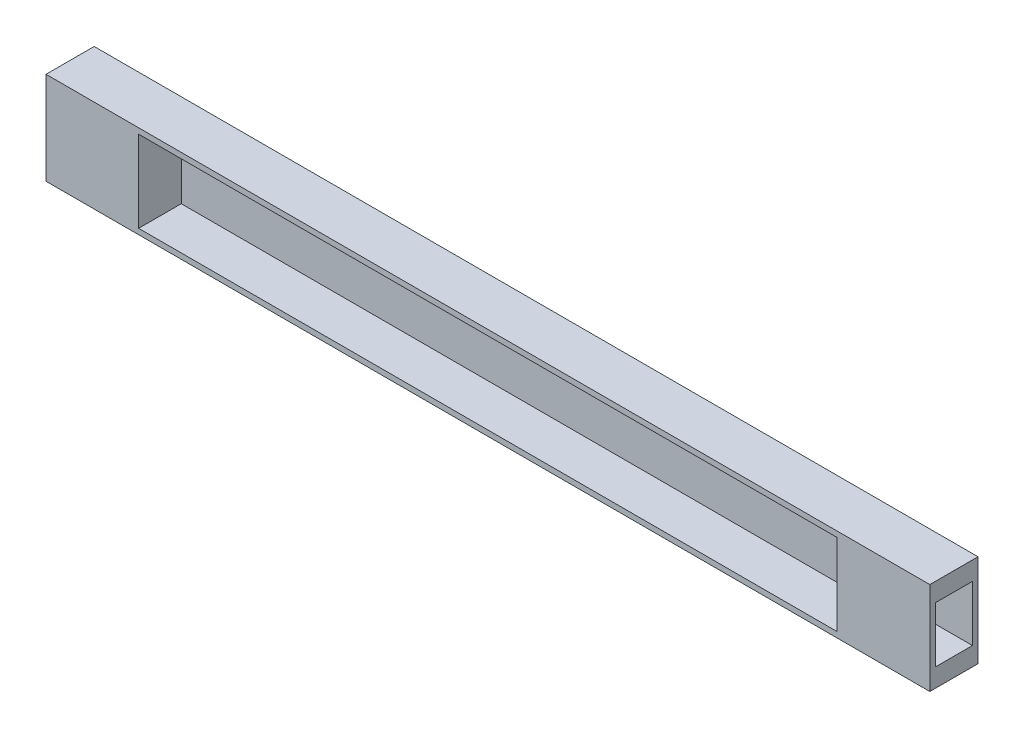
ISO-10303-21;
HEADER;
FILE_DESCRIPTION(('STEP AP214'),'2;1');
FILE_NAME('part.step','',(''),(''),'','','');
FILE_SCHEMA(('AUTOMOTIVE_DESIGN { 1 0 10303 214 1 1 1 1 }'));
ENDSEC;
DATA;
#1=APPLICATION_CONTEXT('core data for automotive mechanical design processes');
#2=APPLICATION_PROTOCOL_DEFINITION('international standard','automotive_design',2000,#1);
#3=PRODUCT_CONTEXT('',#1,'mechanical');
#4=PRODUCT('Part','Part','',(#3));
#5=PRODUCT_RELATED_PRODUCT_CATEGORY('part','',(#4));
#6=PRODUCT_DEFINITION_FORMATION('','',#4);
#7=PRODUCT_DEFINITION_CONTEXT('part definition',#1,'design');
#8=PRODUCT_DEFINITION('design','',#6,#7);
#9=PRODUCT_DEFINITION_SHAPE('','',#8);
#10=(LENGTH_UNIT() NAMED_UNIT(*) SI_UNIT(.MILLI.,.METRE.));
#11=(NAMED_UNIT(*) PLANE_ANGLE_UNIT() SI_UNIT($,.RADIAN.));
#12=(NAMED_UNIT(*) SI_UNIT($,.STERADIAN.) SOLID_ANGLE_UNIT());
#13=UNCERTAINTY_MEASURE_WITH_UNIT(LENGTH_MEASURE(1.E-05),#10,'distance_accuracy_value','');
#14=(GEOMETRIC_REPRESENTATION_CONTEXT(3) GLOBAL_UNCERTAINTY_ASSIGNED_CONTEXT((#13)) GLOBAL_UNIT_ASSIGNED_CONTEXT((#10,
#11,#12)) REPRESENTATION_CONTEXT('',''));
#15=CARTESIAN_POINT('',(0.,0.,0.));
#16=DIRECTION('',(0.,0.,1.));
#17=DIRECTION('',(1.,0.,0.));
#18=AXIS2_PLACEMENT_3D('',#15,#16,#17);
#19=CARTESIAN_POINT('',(416.000008583069,119.999997317791,488.000005483627));
#20=DIRECTION('',(1.,0.,0.));
#21=DIRECTION('',(0.,0.,-1.));
#22=AXIS2_PLACEMENT_3D('',#19,#20,#21);
#23=PLANE('',#22);
#24=DIRECTION('',(0.,1.,0.));
#25=VECTOR('',#24,1.);
#26=CARTESIAN_POINT('',(416.000008583069,119.999997317791,513.999998569489));
#27=LINE('',#26,#25);
#28=CARTESIAN_POINT('',(416.000008583069,119.999997317791,513.999998569489));
#29=VERTEX_POINT('',#28);
#30=CARTESIAN_POINT('',(416.000008583069,170.000001788139,513.999998569489));
#31=VERTEX_POINT('',#30);
#32=EDGE_CURVE('E317',#29,#31,#27,.T.);
#33=ORIENTED_EDGE('',*,*,#32,.F.);
#34=DIRECTION('',(0.,0.,1.));
#35=VECTOR('',#34,1.);
#36=CARTESIAN_POINT('',(416.000008583069,119.999997317791,488.000005483627));
#37=LINE('',#36,#35);
#38=CARTESIAN_POINT('',(416.000008583069,119.999997317791,488.000005483627));
#39=VERTEX_POINT('',#38);
#40=EDGE_CURVE('E41',#39,#29,#37,.T.);
#41=ORIENTED_EDGE('',*,*,#40,.F.);
#42=DIRECTION('',(0.,1.,0.));
#43=VECTOR('',#42,1.);
#44=CARTESIAN_POINT('',(416.000008583069,119.999997317791,488.000005483627));
#45=LINE('',#44,#43);
#46=CARTESIAN_POINT('',(416.000008583069,170.000001788139,488.000005483627));
#47=VERTEX_POINT('',#46);
#48=EDGE_CURVE('E320',#39,#47,#45,.T.);
#49=ORIENTED_EDGE('',*,*,#48,.T.);
#50=DIRECTION('',(0.,0.,1.));
#51=VECTOR('',#50,1.);
#52=CARTESIAN_POINT('',(416.000008583069,170.000001788139,488.000005483627));
#53=LINE('',#52,#51);
#54=EDGE_CURVE('E12',#47,#31,#53,.T.);
#55=ORIENTED_EDGE('',*,*,#54,.T.);
#56=EDGE_LOOP('',(#33,#41,#49,#55));
#57=FACE_BOUND('',#56,.T.);
#58=DIRECTION('',(0.,1.,0.));
#59=VECTOR('',#58,1.);
#60=CARTESIAN_POINT('',(416.000008583069,129.999999552965,511.000002026558));
#61=LINE('',#60,#59);
#62=CARTESIAN_POINT('',(416.000008583069,129.999999552965,511.000002026558));
#63=VERTEX_POINT('',#62);
#64=CARTESIAN_POINT('',(416.000008583069,159.999999552965,511.000002026558));
#65=VERTEX_POINT('',#64);
#66=EDGE_CURVE('E267',#63,#65,#61,.T.);
#67=ORIENTED_EDGE('',*,*,#66,.T.);
#68=DIRECTION('',(0.,0.,-1.));
#69=VECTOR('',#68,1.);
#70=CARTESIAN_POINT('',(416.000008583069,159.999999552965,511.000002026558));
#71=LINE('',#70,#69);
#72=CARTESIAN_POINT('',(416.000008583069,159.999999552965,491.000002026558));
#73=VERTEX_POINT('',#72);
#74=EDGE_CURVE('E261',#65,#73,#71,.T.);
#75=ORIENTED_EDGE('',*,*,#74,.T.);
#76=DIRECTION('',(0.,1.,0.));
#77=VECTOR('',#76,1.);
#78=CARTESIAN_POINT('',(416.000008583069,129.999999552965,491.000002026558));
#79=LINE('',#78,#77);
#80=CARTESIAN_POINT('',(416.000008583069,129.999999552965,491.000002026558));
#81=VERTEX_POINT('',#80);
#82=EDGE_CURVE('E278',#81,#73,#79,.T.);
#83=ORIENTED_EDGE('',*,*,#82,.F.);
#84=DIRECTION('',(0.,0.,-1.));
#85=VECTOR('',#84,1.);
#86=CARTESIAN_POINT('',(416.000008583069,129.999999552965,511.000002026558));
#87=LINE('',#86,#85);
#88=EDGE_CURVE('E281',#63,#81,#87,.T.);
#89=ORIENTED_EDGE('',*,*,#88,.F.);
#90=EDGE_LOOP('',(#67,#75,#83,#89));
#91=FACE_BOUND('',#90,.T.);
#92=ADVANCED_FACE('F37',(#57,#91),#23,.T.);
#93=CARTESIAN_POINT('',(416.000008583069,170.000001788139,488.000005483627));
#94=DIRECTION('',(0.,1.,0.));
#95=DIRECTION('',(0.,0.,1.));
#96=AXIS2_PLACEMENT_3D('',#93,#94,#95);
#97=PLANE('',#96);
#98=DIRECTION('',(-1.,0.,0.));
#99=VECTOR('',#98,1.);
#100=CARTESIAN_POINT('',(416.000008583069,170.000001788139,513.999998569489));
#101=LINE('',#100,#99);
#102=CARTESIAN_POINT('',(-61.0000099539757,170.000001788139,513.999998569489));
#103=VERTEX_POINT('',#102);
#104=EDGE_CURVE('E308',#31,#103,#101,.T.);
#105=ORIENTED_EDGE('',*,*,#104,.F.);
#106=ORIENTED_EDGE('',*,*,#54,.F.);
#107=DIRECTION('',(-1.,0.,0.));
#108=VECTOR('',#107,1.);
#109=CARTESIAN_POINT('',(416.000008583069,170.000001788139,488.000005483627));
#110=LINE('',#109,#108);
#111=CARTESIAN_POINT('',(-61.0000099539757,170.000001788139,488.000005483627));
#112=VERTEX_POINT('',#111);
#113=EDGE_CURVE('E314',#47,#112,#110,.T.);
#114=ORIENTED_EDGE('',*,*,#113,.T.);
#115=DIRECTION('',(0.,0.,1.));
#116=VECTOR('',#115,1.);
#117=CARTESIAN_POINT('',(-61.0000099539757,170.000001788139,488.000005483627));
#118=LINE('',#117,#116);
#119=EDGE_CURVE('E258',#112,#103,#118,.T.);
#120=ORIENTED_EDGE('',*,*,#119,.T.);
#121=EDGE_LOOP('',(#105,#106,#114,#120));
#122=FACE_BOUND('',#121,.T.);
#123=ADVANCED_FACE('F39',(#122),#97,.T.);
#124=CARTESIAN_POINT('',(-61.0000006854534,119.999997317791,488.000005483627));
#125=DIRECTION('',(0.,-1.,0.));
#126=DIRECTION('',(0.,0.,-1.));
#127=AXIS2_PLACEMENT_3D('',#124,#125,#126);
#128=PLANE('',#127);
#129=DIRECTION('',(1.,0.,0.));
#130=VECTOR('',#129,1.);
#131=CARTESIAN_POINT('',(-61.0000006854534,119.999997317791,513.999998569489));
#132=LINE('',#131,#130);
#133=CARTESIAN_POINT('',(-61.0000099539757,119.999997317791,513.999998569489));
#134=VERTEX_POINT('',#133);
#135=EDGE_CURVE('E324',#134,#29,#132,.T.);
#136=ORIENTED_EDGE('',*,*,#135,.F.);
#137=DIRECTION('',(0.,0.,1.));
#138=VECTOR('',#137,1.);
#139=CARTESIAN_POINT('',(-61.0000099539757,119.999997317791,488.000005483627));
#140=LINE('',#139,#138);
#141=CARTESIAN_POINT('',(-61.0000099539757,119.999997317791,488.000005483627));
#142=VERTEX_POINT('',#141);
#143=EDGE_CURVE('E255',#142,#134,#140,.T.);
#144=ORIENTED_EDGE('',*,*,#143,.F.);
#145=DIRECTION('',(1.,0.,0.));
#146=VECTOR('',#145,1.);
#147=CARTESIAN_POINT('',(-61.0000006854534,119.999997317791,488.000005483627));
#148=LINE('',#147,#146);
#149=EDGE_CURVE('E316',#142,#39,#148,.T.);
#150=ORIENTED_EDGE('',*,*,#149,.T.);
#151=ORIENTED_EDGE('',*,*,#40,.T.);
#152=EDGE_LOOP('',(#136,#144,#150,#151));
#153=FACE_BOUND('',#152,.T.);
#154=ADVANCED_FACE('F345',(#153),#128,.T.);
#155=CARTESIAN_POINT('',(0.,0.,488.000005483627));
#156=DIRECTION('',(0.,0.,1.));
#157=DIRECTION('',(1.,0.,0.));
#158=AXIS2_PLACEMENT_3D('',#155,#156,#157);
#159=PLANE('',#158);
#160=DIRECTION('',(0.,1.,0.));
#161=VECTOR('',#160,1.);
#162=CARTESIAN_POINT('',(187.499999314547,134.999999552965,488.000005483627));
#163=LINE('',#162,#161);
#164=CARTESIAN_POINT('',(187.499999314547,134.999999552965,488.000005483627));
#165=VERTEX_POINT('',#164);
#166=CARTESIAN_POINT('',(187.499999314547,154.999999552965,488.000005483627));
#167=VERTEX_POINT('',#166);
#168=EDGE_CURVE('E52',#165,#167,#163,.T.);
#169=ORIENTED_EDGE('',*,*,#168,.T.);
#170=DIRECTION('',(-1.,0.,0.));
#171=VECTOR('',#170,1.);
#172=CARTESIAN_POINT('',(187.499999314547,154.999999552965,488.000005483627));
#173=LINE('',#172,#171);
#174=CARTESIAN_POINT('',(167.499999314547,154.999999552965,488.000005483627));
#175=VERTEX_POINT('',#174);
#176=EDGE_CURVE('E202',#167,#175,#173,.T.);
#177=ORIENTED_EDGE('',*,*,#176,.T.);
#178=DIRECTION('',(0.,1.,0.));
#179=VECTOR('',#178,1.);
#180=CARTESIAN_POINT('',(167.499999314547,134.999999552965,488.000005483627));
#181=LINE('',#180,#179);
#182=CARTESIAN_POINT('',(167.499999314547,134.999999552965,488.000005483627));
#183=VERTEX_POINT('',#182);
#184=EDGE_CURVE('E189',#183,#175,#181,.T.);
#185=ORIENTED_EDGE('',*,*,#184,.F.);
#186=DIRECTION('',(-1.,0.,0.));
#187=VECTOR('',#186,1.);
#188=CARTESIAN_POINT('',(187.499999314547,134.999999552965,488.000005483627));
#189=LINE('',#188,#187);
#190=EDGE_CURVE('E57',#165,#183,#189,.T.);
#191=ORIENTED_EDGE('',*,*,#190,.F.);
#192=EDGE_LOOP('',(#169,#177,#185,#191));
#193=FACE_BOUND('',#192,.T.);
#194=ORIENTED_EDGE('',*,*,#113,.F.);
#195=ORIENTED_EDGE('',*,*,#48,.F.);
#196=ORIENTED_EDGE('',*,*,#149,.F.);
#197=DIRECTION('',(0.,1.,0.));
#198=VECTOR('',#197,1.);
#199=CARTESIAN_POINT('',(-61.0000099539757,119.999997317791,488.000005483627));
#200=LINE('',#199,#198);
#201=EDGE_CURVE('E252',#142,#112,#200,.T.);
#202=ORIENTED_EDGE('',*,*,#201,.T.);
#203=EDGE_LOOP('',(#194,#195,#196,#202));
#204=FACE_BOUND('',#203,.T.);
#205=ADVANCED_FACE('F347',(#193,#204),#159,.F.);
#206=CARTESIAN_POINT('',(0.,0.,513.999998569489));
#207=DIRECTION('',(0.,0.,1.));
#208=DIRECTION('',(1.,0.,0.));
#209=AXIS2_PLACEMENT_3D('',#206,#207,#208);
#210=PLANE('',#209);
#211=DIRECTION('',(0.,1.,0.));
#212=VECTOR('',#211,1.);
#213=CARTESIAN_POINT('',(-10.9999980330467,123.000003397465,513.999998569489));
#214=LINE('',#213,#212);
#215=CARTESIAN_POINT('',(-10.9999980330467,123.000003397465,513.999998569489));
#216=VERTEX_POINT('',#215);
#217=CARTESIAN_POINT('',(-10.9999980330467,166.999995708466,513.999998569489));
#218=VERTEX_POINT('',#217);
#219=EDGE_CURVE('E239',#216,#218,#214,.T.);
#220=ORIENTED_EDGE('',*,*,#219,.T.);
#221=DIRECTION('',(-1.,0.,0.));
#222=VECTOR('',#221,1.);
#223=CARTESIAN_POINT('',(365.99999666214,166.999995708466,513.999998569489));
#224=LINE('',#223,#222);
#225=CARTESIAN_POINT('',(365.99999666214,166.999995708466,513.999998569489));
#226=VERTEX_POINT('',#225);
#227=EDGE_CURVE('E305',#226,#218,#224,.T.);
#228=ORIENTED_EDGE('',*,*,#227,.F.);
#229=DIRECTION('',(0.,1.,0.));
#230=VECTOR('',#229,1.);
#231=CARTESIAN_POINT('',(365.99999666214,123.000003397465,513.999998569489));
#232=LINE('',#231,#230);
#233=CARTESIAN_POINT('',(365.99999666214,123.000003397465,513.999998569489));
#234=VERTEX_POINT('',#233);
#235=EDGE_CURVE('E294',#234,#226,#232,.T.);
#236=ORIENTED_EDGE('',*,*,#235,.F.);
#237=DIRECTION('',(-1.,0.,0.));
#238=VECTOR('',#237,1.);
#239=CARTESIAN_POINT('',(365.99999666214,123.000003397465,513.999998569489));
#240=LINE('',#239,#238);
#241=EDGE_CURVE('E306',#234,#216,#240,.T.);
#242=ORIENTED_EDGE('',*,*,#241,.T.);
#243=EDGE_LOOP('',(#220,#228,#236,#242));
#244=FACE_BOUND('',#243,.T.);
#245=ORIENTED_EDGE('',*,*,#104,.T.);
#246=DIRECTION('',(0.,1.,0.));
#247=VECTOR('',#246,1.);
#248=CARTESIAN_POINT('',(-61.0000099539757,119.999997317791,513.999998569489));
#249=LINE('',#248,#247);
#250=EDGE_CURVE('E251',#134,#103,#249,.T.);
#251=ORIENTED_EDGE('',*,*,#250,.F.);
#252=ORIENTED_EDGE('',*,*,#135,.T.);
#253=ORIENTED_EDGE('',*,*,#32,.T.);
#254=EDGE_LOOP('',(#245,#251,#252,#253));
#255=FACE_BOUND('',#254,.T.);
#256=ADVANCED_FACE('F330',(#244,#255),#210,.T.);
#257=CARTESIAN_POINT('',(365.99999666214,123.000003397465,490.99999666214));
#258=DIRECTION('',(0.,-1.,0.));
#259=DIRECTION('',(0.,0.,-1.));
#260=AXIS2_PLACEMENT_3D('',#257,#258,#259);
#261=PLANE('',#260);
#262=DIRECTION('',(-1.,0.,0.));
#263=VECTOR('',#262,1.);
#264=CARTESIAN_POINT('',(365.99999666214,123.000003397465,490.99999666214));
#265=LINE('',#264,#263);
#266=CARTESIAN_POINT('',(365.99999666214,123.000003397465,490.99999666214));
#267=VERTEX_POINT('',#266);
#268=CARTESIAN_POINT('',(-10.9999980330467,123.000003397465,490.99999666214));
#269=VERTEX_POINT('',#268);
#270=EDGE_CURVE('E309',#267,#269,#265,.T.);
#271=ORIENTED_EDGE('',*,*,#270,.T.);
#272=DIRECTION('',(0.,0.,1.));
#273=VECTOR('',#272,1.);
#274=CARTESIAN_POINT('',(-10.9999980330467,123.000003397465,490.99999666214));
#275=LINE('',#274,#273);
#276=EDGE_CURVE('E248',#269,#216,#275,.T.);
#277=ORIENTED_EDGE('',*,*,#276,.T.);
#278=ORIENTED_EDGE('',*,*,#241,.F.);
#279=DIRECTION('',(0.,0.,1.));
#280=VECTOR('',#279,1.);
#281=CARTESIAN_POINT('',(365.99999666214,123.000003397465,490.99999666214));
#282=LINE('',#281,#280);
#283=EDGE_CURVE('E303',#267,#234,#282,.T.);
#284=ORIENTED_EDGE('',*,*,#283,.F.);
#285=EDGE_LOOP('',(#271,#277,#278,#284));
#286=FACE_BOUND('',#285,.T.);
#287=ADVANCED_FACE('F354',(#286),#261,.F.);
#288=CARTESIAN_POINT('',(365.99999666214,166.999995708466,490.99999666214));
#289=DIRECTION('',(0.,0.,-1.));
#290=DIRECTION('',(-1.,0.,0.));
#291=AXIS2_PLACEMENT_3D('',#288,#289,#290);
#292=PLANE('',#291);
#293=DIRECTION('',(-1.,0.,0.));
#294=VECTOR('',#293,1.);
#295=CARTESIAN_POINT('',(365.99999666214,166.999995708466,490.99999666214));
#296=LINE('',#295,#294);
#297=CARTESIAN_POINT('',(365.99999666214,166.999995708466,490.99999666214));
#298=VERTEX_POINT('',#297);
#299=CARTESIAN_POINT('',(-10.9999980330467,166.999995708466,490.99999666214));
#300=VERTEX_POINT('',#299);
#301=EDGE_CURVE('E311',#298,#300,#296,.T.);
#302=ORIENTED_EDGE('',*,*,#301,.T.);
#303=DIRECTION('',(0.,-1.,0.));
#304=VECTOR('',#303,1.);
#305=CARTESIAN_POINT('',(-10.9999980330467,166.999995708466,490.99999666214));
#306=LINE('',#305,#304);
#307=EDGE_CURVE('E245',#300,#269,#306,.T.);
#308=ORIENTED_EDGE('',*,*,#307,.T.);
#309=ORIENTED_EDGE('',*,*,#270,.F.);
#310=DIRECTION('',(0.,-1.,0.));
#311=VECTOR('',#310,1.);
#312=CARTESIAN_POINT('',(365.99999666214,166.999995708466,490.99999666214));
#313=LINE('',#312,#311);
#314=EDGE_CURVE('E300',#298,#267,#313,.T.);
#315=ORIENTED_EDGE('',*,*,#314,.F.);
#316=EDGE_LOOP('',(#302,#308,#309,#315));
#317=FACE_BOUND('',#316,.T.);
#318=ADVANCED_FACE('F388',(#317),#292,.F.);
#319=CARTESIAN_POINT('',(365.99999666214,166.999995708466,513.999998569489));
#320=DIRECTION('',(0.,1.,0.));
#321=DIRECTION('',(0.,0.,1.));
#322=AXIS2_PLACEMENT_3D('',#319,#320,#321);
#323=PLANE('',#322);
#324=ORIENTED_EDGE('',*,*,#227,.T.);
#325=DIRECTION('',(0.,0.,-1.));
#326=VECTOR('',#325,1.);
#327=CARTESIAN_POINT('',(-10.9999980330467,166.999995708466,513.999998569489));
#328=LINE('',#327,#326);
#329=EDGE_CURVE('E242',#218,#300,#328,.T.);
#330=ORIENTED_EDGE('',*,*,#329,.T.);
#331=ORIENTED_EDGE('',*,*,#301,.F.);
#332=DIRECTION('',(0.,0.,-1.));
#333=VECTOR('',#332,1.);
#334=CARTESIAN_POINT('',(365.99999666214,166.999995708466,513.999998569489));
#335=LINE('',#334,#333);
#336=EDGE_CURVE('E297',#226,#298,#335,.T.);
#337=ORIENTED_EDGE('',*,*,#336,.F.);
#338=EDGE_LOOP('',(#324,#330,#331,#337));
#339=FACE_BOUND('',#338,.T.);
#340=ADVANCED_FACE('F399',(#339),#323,.F.);
#341=CARTESIAN_POINT('',(365.99999666214,0.,0.));
#342=DIRECTION('',(-1.,0.,0.));
#343=DIRECTION('',(0.,0.,1.));
#344=AXIS2_PLACEMENT_3D('',#341,#342,#343);
#345=PLANE('',#344);
#346=ORIENTED_EDGE('',*,*,#235,.T.);
#347=ORIENTED_EDGE('',*,*,#336,.T.);
#348=ORIENTED_EDGE('',*,*,#314,.T.);
#349=ORIENTED_EDGE('',*,*,#283,.T.);
#350=EDGE_LOOP('',(#346,#347,#348,#349));
#351=FACE_BOUND('',#350,.T.);
#352=ADVANCED_FACE('F410',(#351),#345,.T.);
#353=CARTESIAN_POINT('',(386.000008583069,159.999999552965,511.000002026558));
#354=DIRECTION('',(0.,-1.,0.));
#355=DIRECTION('',(0.,0.,-1.));
#356=AXIS2_PLACEMENT_3D('',#353,#354,#355);
#357=PLANE('',#356);
#358=ORIENTED_EDGE('',*,*,#74,.F.);
#359=DIRECTION('',(1.,0.,0.));
#360=VECTOR('',#359,1.);
#361=CARTESIAN_POINT('',(386.000008583069,159.999999552965,511.000002026558));
#362=LINE('',#361,#360);
#363=CARTESIAN_POINT('',(386.000008583069,159.999999552965,511.000002026558));
#364=VERTEX_POINT('',#363);
#365=EDGE_CURVE('E275',#364,#65,#362,.T.);
#366=ORIENTED_EDGE('',*,*,#365,.F.);
#367=DIRECTION('',(0.,0.,-1.));
#368=VECTOR('',#367,1.);
#369=CARTESIAN_POINT('',(386.000008583069,159.999999552965,511.000002026558));
#370=LINE('',#369,#368);
#371=CARTESIAN_POINT('',(386.000008583069,159.999999552965,491.000002026558));
#372=VERTEX_POINT('',#371);
#373=EDGE_CURVE('E264',#364,#372,#370,.T.);
#374=ORIENTED_EDGE('',*,*,#373,.T.);
#375=DIRECTION('',(1.,0.,0.));
#376=VECTOR('',#375,1.);
#377=CARTESIAN_POINT('',(386.000008583069,159.999999552965,491.000002026558));
#378=LINE('',#377,#376);
#379=EDGE_CURVE('E292',#372,#73,#378,.T.);
#380=ORIENTED_EDGE('',*,*,#379,.T.);
#381=EDGE_LOOP('',(#358,#366,#374,#380));
#382=FACE_BOUND('',#381,.T.);
#383=ADVANCED_FACE('F549',(#382),#357,.T.);
#384=CARTESIAN_POINT('',(386.000008583069,129.999999552965,491.000002026558));
#385=DIRECTION('',(0.,0.,-1.));
#386=DIRECTION('',(-1.,0.,0.));
#387=AXIS2_PLACEMENT_3D('',#384,#385,#386);
#388=PLANE('',#387);
#389=ORIENTED_EDGE('',*,*,#82,.T.);
#390=ORIENTED_EDGE('',*,*,#379,.F.);
#391=DIRECTION('',(0.,1.,0.));
#392=VECTOR('',#391,1.);
#393=CARTESIAN_POINT('',(386.000008583069,129.999999552965,491.000002026558));
#394=LINE('',#393,#392);
#395=CARTESIAN_POINT('',(386.000008583069,129.999999552965,491.000002026558));
#396=VERTEX_POINT('',#395);
#397=EDGE_CURVE('E266',#396,#372,#394,.T.);
#398=ORIENTED_EDGE('',*,*,#397,.F.);
#399=DIRECTION('',(1.,0.,0.));
#400=VECTOR('',#399,1.);
#401=CARTESIAN_POINT('',(386.000008583069,129.999999552965,491.000002026558));
#402=LINE('',#401,#400);
#403=EDGE_CURVE('E290',#396,#81,#402,.T.);
#404=ORIENTED_EDGE('',*,*,#403,.T.);
#405=EDGE_LOOP('',(#389,#390,#398,#404));
#406=FACE_BOUND('',#405,.T.);
#407=ADVANCED_FACE('F545',(#406),#388,.F.);
#408=CARTESIAN_POINT('',(386.000008583069,129.999999552965,511.000002026558));
#409=DIRECTION('',(0.,-1.,0.));
#410=DIRECTION('',(0.,0.,-1.));
#411=AXIS2_PLACEMENT_3D('',#408,#409,#410);
#412=PLANE('',#411);
#413=ORIENTED_EDGE('',*,*,#88,.T.);
#414=ORIENTED_EDGE('',*,*,#403,.F.);
#415=DIRECTION('',(0.,0.,-1.));
#416=VECTOR('',#415,1.);
#417=CARTESIAN_POINT('',(386.000008583069,129.999999552965,511.000002026558));
#418=LINE('',#417,#416);
#419=CARTESIAN_POINT('',(386.000008583069,129.999999552965,511.000002026558));
#420=VERTEX_POINT('',#419);
#421=EDGE_CURVE('E270',#420,#396,#418,.T.);
#422=ORIENTED_EDGE('',*,*,#421,.F.);
#423=DIRECTION('',(1.,0.,0.));
#424=VECTOR('',#423,1.);
#425=CARTESIAN_POINT('',(386.000008583069,129.999999552965,511.000002026558));
#426=LINE('',#425,#424);
#427=EDGE_CURVE('E288',#420,#63,#426,.T.);
#428=ORIENTED_EDGE('',*,*,#427,.T.);
#429=EDGE_LOOP('',(#413,#414,#422,#428));
#430=FACE_BOUND('',#429,.T.);
#431=ADVANCED_FACE('F541',(#430),#412,.F.);
#432=CARTESIAN_POINT('',(386.000008583069,129.999999552965,511.000002026558));
#433=DIRECTION('',(0.,0.,-1.));
#434=DIRECTION('',(-1.,0.,0.));
#435=AXIS2_PLACEMENT_3D('',#432,#433,#434);
#436=PLANE('',#435);
#437=ORIENTED_EDGE('',*,*,#66,.F.);
#438=ORIENTED_EDGE('',*,*,#427,.F.);
#439=DIRECTION('',(0.,1.,0.));
#440=VECTOR('',#439,1.);
#441=CARTESIAN_POINT('',(386.000008583069,129.999999552965,511.000002026558));
#442=LINE('',#441,#440);
#443=EDGE_CURVE('E273',#420,#364,#442,.T.);
#444=ORIENTED_EDGE('',*,*,#443,.T.);
#445=ORIENTED_EDGE('',*,*,#365,.T.);
#446=EDGE_LOOP('',(#437,#438,#444,#445));
#447=FACE_BOUND('',#446,.T.);
#448=ADVANCED_FACE('F537',(#447),#436,.T.);
#449=CARTESIAN_POINT('',(386.000008583069,0.,0.));
#450=DIRECTION('',(1.,0.,0.));
#451=DIRECTION('',(0.,0.,-1.));
#452=AXIS2_PLACEMENT_3D('',#449,#450,#451);
#453=PLANE('',#452);
#454=ORIENTED_EDGE('',*,*,#373,.F.);
#455=ORIENTED_EDGE('',*,*,#443,.F.);
#456=ORIENTED_EDGE('',*,*,#421,.T.);
#457=ORIENTED_EDGE('',*,*,#397,.T.);
#458=EDGE_LOOP('',(#454,#455,#456,#457));
#459=FACE_BOUND('',#458,.T.);
#460=ADVANCED_FACE('F423',(#459),#453,.T.);
#461=CARTESIAN_POINT('',(-61.0000099539757,119.999997317791,488.000005483627));
#462=DIRECTION('',(-1.,0.,0.));
#463=DIRECTION('',(0.,0.,-1.));
#464=AXIS2_PLACEMENT_3D('',#461,#462,#463);
#465=PLANE('',#464);
#466=ORIENTED_EDGE('',*,*,#250,.T.);
#467=ORIENTED_EDGE('',*,*,#119,.F.);
#468=ORIENTED_EDGE('',*,*,#201,.F.);
#469=ORIENTED_EDGE('',*,*,#143,.T.);
#470=EDGE_LOOP('',(#466,#467,#468,#469));
#471=FACE_BOUND('',#470,.T.);
#472=DIRECTION('',(0.,1.,0.));
#473=VECTOR('',#472,1.);
#474=CARTESIAN_POINT('',(-61.0000099539757,129.999999552965,511.000002026558));
#475=LINE('',#474,#473);
#476=CARTESIAN_POINT('',(-61.0000099539757,129.999999552965,511.000002026558));
#477=VERTEX_POINT('',#476);
#478=CARTESIAN_POINT('',(-61.0000099539757,159.999999552965,511.000002026558));
#479=VERTEX_POINT('',#478);
#480=EDGE_CURVE('E215',#477,#479,#475,.T.);
#481=ORIENTED_EDGE('',*,*,#480,.F.);
#482=DIRECTION('',(0.,0.,-1.));
#483=VECTOR('',#482,1.);
#484=CARTESIAN_POINT('',(-61.0000099539757,129.999999552965,511.000002026558));
#485=LINE('',#484,#483);
#486=CARTESIAN_POINT('',(-61.0000099539757,129.999999552965,491.000002026558));
#487=VERTEX_POINT('',#486);
#488=EDGE_CURVE('E227',#477,#487,#485,.T.);
#489=ORIENTED_EDGE('',*,*,#488,.T.);
#490=DIRECTION('',(0.,1.,0.));
#491=VECTOR('',#490,1.);
#492=CARTESIAN_POINT('',(-61.0000099539757,129.999999552965,491.000002026558));
#493=LINE('',#492,#491);
#494=CARTESIAN_POINT('',(-61.0000099539757,159.999999552965,491.000002026558));
#495=VERTEX_POINT('',#494);
#496=EDGE_CURVE('E224',#487,#495,#493,.T.);
#497=ORIENTED_EDGE('',*,*,#496,.T.);
#498=DIRECTION('',(0.,0.,-1.));
#499=VECTOR('',#498,1.);
#500=CARTESIAN_POINT('',(-61.0000099539757,159.999999552965,511.000002026558));
#501=LINE('',#500,#499);
#502=EDGE_CURVE('E207',#479,#495,#501,.T.);
#503=ORIENTED_EDGE('',*,*,#502,.F.);
#504=EDGE_LOOP('',(#481,#489,#497,#503));
#505=FACE_BOUND('',#504,.T.);
#506=ADVANCED_FACE('F341',(#471,#505),#465,.T.);
#507=CARTESIAN_POINT('',(-10.9999980330467,0.,0.));
#508=DIRECTION('',(1.,0.,0.));
#509=DIRECTION('',(0.,0.,1.));
#510=AXIS2_PLACEMENT_3D('',#507,#508,#509);
#511=PLANE('',#510);
#512=ORIENTED_EDGE('',*,*,#219,.F.);
#513=ORIENTED_EDGE('',*,*,#276,.F.);
#514=ORIENTED_EDGE('',*,*,#307,.F.);
#515=ORIENTED_EDGE('',*,*,#329,.F.);
#516=EDGE_LOOP('',(#512,#513,#514,#515));
#517=FACE_BOUND('',#516,.T.);
#518=ADVANCED_FACE('F422',(#517),#511,.T.);
#519=CARTESIAN_POINT('',(-31.0000099539757,159.999999552965,511.000002026558));
#520=DIRECTION('',(0.,-1.,0.));
#521=DIRECTION('',(0.,0.,-1.));
#522=AXIS2_PLACEMENT_3D('',#519,#520,#521);
#523=PLANE('',#522);
#524=ORIENTED_EDGE('',*,*,#502,.T.);
#525=DIRECTION('',(-1.,0.,0.));
#526=VECTOR('',#525,1.);
#527=CARTESIAN_POINT('',(-31.0000099539757,159.999999552965,491.000002026558));
#528=LINE('',#527,#526);
#529=CARTESIAN_POINT('',(-31.0000099539757,159.999999552965,491.000002026558));
#530=VERTEX_POINT('',#529);
#531=EDGE_CURVE('E237',#530,#495,#528,.T.);
#532=ORIENTED_EDGE('',*,*,#531,.F.);
#533=DIRECTION('',(0.,0.,-1.));
#534=VECTOR('',#533,1.);
#535=CARTESIAN_POINT('',(-31.0000099539757,159.999999552965,511.000002026558));
#536=LINE('',#535,#534);
#537=CARTESIAN_POINT('',(-31.0000099539757,159.999999552965,511.000002026558));
#538=VERTEX_POINT('',#537);
#539=EDGE_CURVE('E211',#538,#530,#536,.T.);
#540=ORIENTED_EDGE('',*,*,#539,.F.);
#541=DIRECTION('',(-1.,0.,0.));
#542=VECTOR('',#541,1.);
#543=CARTESIAN_POINT('',(-31.0000099539757,159.999999552965,511.000002026558));
#544=LINE('',#543,#542);
#545=EDGE_CURVE('E221',#538,#479,#544,.T.);
#546=ORIENTED_EDGE('',*,*,#545,.T.);
#547=EDGE_LOOP('',(#524,#532,#540,#546));
#548=FACE_BOUND('',#547,.T.);
#549=ADVANCED_FACE('F433',(#548),#523,.T.);
#550=CARTESIAN_POINT('',(-31.0000099539757,129.999999552965,491.000002026558));
#551=DIRECTION('',(0.,0.,-1.));
#552=DIRECTION('',(1.,0.,0.));
#553=AXIS2_PLACEMENT_3D('',#550,#551,#552);
#554=PLANE('',#553);
#555=ORIENTED_EDGE('',*,*,#496,.F.);
#556=DIRECTION('',(-1.,0.,0.));
#557=VECTOR('',#556,1.);
#558=CARTESIAN_POINT('',(-31.0000099539757,129.999999552965,491.000002026558));
#559=LINE('',#558,#557);
#560=CARTESIAN_POINT('',(-31.0000099539757,129.999999552965,491.000002026558));
#561=VERTEX_POINT('',#560);
#562=EDGE_CURVE('E235',#561,#487,#559,.T.);
#563=ORIENTED_EDGE('',*,*,#562,.F.);
#564=DIRECTION('',(0.,1.,0.));
#565=VECTOR('',#564,1.);
#566=CARTESIAN_POINT('',(-31.0000099539757,129.999999552965,491.000002026558));
#567=LINE('',#566,#565);
#568=EDGE_CURVE('E214',#561,#530,#567,.T.);
#569=ORIENTED_EDGE('',*,*,#568,.T.);
#570=ORIENTED_EDGE('',*,*,#531,.T.);
#571=EDGE_LOOP('',(#555,#563,#569,#570));
#572=FACE_BOUND('',#571,.T.);
#573=ADVANCED_FACE('F443',(#572),#554,.F.);
#574=CARTESIAN_POINT('',(-31.0000099539757,129.999999552965,511.000002026558));
#575=DIRECTION('',(0.,-1.,0.));
#576=DIRECTION('',(0.,0.,-1.));
#577=AXIS2_PLACEMENT_3D('',#574,#575,#576);
#578=PLANE('',#577);
#579=ORIENTED_EDGE('',*,*,#488,.F.);
#580=DIRECTION('',(-1.,0.,0.));
#581=VECTOR('',#580,1.);
#582=CARTESIAN_POINT('',(-31.0000099539757,129.999999552965,511.000002026558));
#583=LINE('',#582,#581);
#584=CARTESIAN_POINT('',(-31.0000099539757,129.999999552965,511.000002026558));
#585=VERTEX_POINT('',#584);
#586=EDGE_CURVE('E233',#585,#477,#583,.T.);
#587=ORIENTED_EDGE('',*,*,#586,.F.);
#588=DIRECTION('',(0.,0.,-1.));
#589=VECTOR('',#588,1.);
#590=CARTESIAN_POINT('',(-31.0000099539757,129.999999552965,511.000002026558));
#591=LINE('',#590,#589);
#592=EDGE_CURVE('E217',#585,#561,#591,.T.);
#593=ORIENTED_EDGE('',*,*,#592,.T.);
#594=ORIENTED_EDGE('',*,*,#562,.T.);
#595=EDGE_LOOP('',(#579,#587,#593,#594));
#596=FACE_BOUND('',#595,.T.);
#597=ADVANCED_FACE('F453',(#596),#578,.F.);
#598=CARTESIAN_POINT('',(-31.0000099539757,129.999999552965,511.000002026558));
#599=DIRECTION('',(0.,0.,-1.));
#600=DIRECTION('',(1.,0.,0.));
#601=AXIS2_PLACEMENT_3D('',#598,#599,#600);
#602=PLANE('',#601);
#603=ORIENTED_EDGE('',*,*,#480,.T.);
#604=ORIENTED_EDGE('',*,*,#545,.F.);
#605=DIRECTION('',(0.,1.,0.));
#606=VECTOR('',#605,1.);
#607=CARTESIAN_POINT('',(-31.0000099539757,129.999999552965,511.000002026558));
#608=LINE('',#607,#606);
#609=EDGE_CURVE('E219',#585,#538,#608,.T.);
#610=ORIENTED_EDGE('',*,*,#609,.F.);
#611=ORIENTED_EDGE('',*,*,#586,.T.);
#612=EDGE_LOOP('',(#603,#604,#610,#611));
#613=FACE_BOUND('',#612,.T.);
#614=ADVANCED_FACE('F463',(#613),#602,.T.);
#615=CARTESIAN_POINT('',(-31.0000099539757,0.,0.));
#616=DIRECTION('',(-1.,0.,0.));
#617=DIRECTION('',(0.,0.,-1.));
#618=AXIS2_PLACEMENT_3D('',#615,#616,#617);
#619=PLANE('',#618);
#620=ORIENTED_EDGE('',*,*,#539,.T.);
#621=ORIENTED_EDGE('',*,*,#568,.F.);
#622=ORIENTED_EDGE('',*,*,#592,.F.);
#623=ORIENTED_EDGE('',*,*,#609,.T.);
#624=EDGE_LOOP('',(#620,#621,#622,#623));
#625=FACE_BOUND('',#624,.T.);
#626=ADVANCED_FACE('F473',(#625),#619,.T.);
#627=CARTESIAN_POINT('',(187.499999314547,154.999999552965,478.000005483627));
#628=DIRECTION('',(0.,1.,0.));
#629=DIRECTION('',(0.,0.,1.));
#630=AXIS2_PLACEMENT_3D('',#627,#628,#629);
#631=PLANE('',#630);
#632=ORIENTED_EDGE('',*,*,#176,.F.);
#633=DIRECTION('',(0.,0.,1.));
#634=VECTOR('',#633,1.);
#635=CARTESIAN_POINT('',(187.499999314547,154.999999552965,478.000005483627));
#636=LINE('',#635,#634);
#637=CARTESIAN_POINT('',(187.499999314547,154.999999552965,478.000005483627));
#638=VERTEX_POINT('',#637);
#639=EDGE_CURVE('E196',#638,#167,#636,.T.);
#640=ORIENTED_EDGE('',*,*,#639,.F.);
#641=DIRECTION('',(-1.,0.,0.));
#642=VECTOR('',#641,1.);
#643=CARTESIAN_POINT('',(187.499999314547,154.999999552965,478.000005483627));
#644=LINE('',#643,#642);
#645=CARTESIAN_POINT('',(167.499999314547,154.999999552965,478.000005483627));
#646=VERTEX_POINT('',#645);
#647=EDGE_CURVE('E177',#638,#646,#644,.T.);
#648=ORIENTED_EDGE('',*,*,#647,.T.);
#649=DIRECTION('',(0.,0.,1.));
#650=VECTOR('',#649,1.);
#651=CARTESIAN_POINT('',(167.499999314547,154.999999552965,478.000005483627));
#652=LINE('',#651,#650);
#653=EDGE_CURVE('E187',#646,#175,#652,.T.);
#654=ORIENTED_EDGE('',*,*,#653,.T.);
#655=EDGE_LOOP('',(#632,#640,#648,#654));
#656=FACE_BOUND('',#655,.T.);
#657=ADVANCED_FACE('F195',(#656),#631,.T.);
#658=CARTESIAN_POINT('',(187.499999314547,134.999999552965,478.000005483627));
#659=DIRECTION('',(1.,0.,0.));
#660=DIRECTION('',(0.,0.,-1.));
#661=AXIS2_PLACEMENT_3D('',#658,#659,#660);
#662=PLANE('',#661);
#663=ORIENTED_EDGE('',*,*,#168,.F.);
#664=DIRECTION('',(0.,0.,1.));
#665=VECTOR('',#664,1.);
#666=CARTESIAN_POINT('',(187.499999314547,134.999999552965,478.000005483627));
#667=LINE('',#666,#665);
#668=CARTESIAN_POINT('',(187.499999314547,134.999999552965,478.000005483627));
#669=VERTEX_POINT('',#668);
#670=EDGE_CURVE('E208',#669,#165,#667,.T.);
#671=ORIENTED_EDGE('',*,*,#670,.F.);
#672=DIRECTION('',(0.,1.,0.));
#673=VECTOR('',#672,1.);
#674=CARTESIAN_POINT('',(187.499999314547,134.999999552965,478.000005483627));
#675=LINE('',#674,#673);
#676=EDGE_CURVE('E193',#669,#638,#675,.T.);
#677=ORIENTED_EDGE('',*,*,#676,.T.);
#678=ORIENTED_EDGE('',*,*,#639,.T.);
#679=EDGE_LOOP('',(#663,#671,#677,#678));
#680=FACE_BOUND('',#679,.T.);
#681=ADVANCED_FACE('F496',(#680),#662,.T.);
#682=CARTESIAN_POINT('',(187.499999314547,134.999999552965,478.000005483627));
#683=DIRECTION('',(0.,1.,0.));
#684=DIRECTION('',(0.,0.,1.));
#685=AXIS2_PLACEMENT_3D('',#682,#683,#684);
#686=PLANE('',#685);
#687=ORIENTED_EDGE('',*,*,#190,.T.);
#688=DIRECTION('',(0.,0.,1.));
#689=VECTOR('',#688,1.);
#690=CARTESIAN_POINT('',(167.499999314547,134.999999552965,478.000005483627));
#691=LINE('',#690,#689);
#692=CARTESIAN_POINT('',(167.499999314547,134.999999552965,478.000005483627));
#693=VERTEX_POINT('',#692);
#694=EDGE_CURVE('E192',#693,#183,#691,.T.);
#695=ORIENTED_EDGE('',*,*,#694,.F.);
#696=DIRECTION('',(-1.,0.,0.));
#697=VECTOR('',#696,1.);
#698=CARTESIAN_POINT('',(187.499999314547,134.999999552965,478.000005483627));
#699=LINE('',#698,#697);
#700=EDGE_CURVE('E180',#669,#693,#699,.T.);
#701=ORIENTED_EDGE('',*,*,#700,.F.);
#702=ORIENTED_EDGE('',*,*,#670,.T.);
#703=EDGE_LOOP('',(#687,#695,#701,#702));
#704=FACE_BOUND('',#703,.T.);
#705=ADVANCED_FACE('F505',(#704),#686,.F.);
#706=CARTESIAN_POINT('',(167.499999314547,134.999999552965,478.000005483627));
#707=DIRECTION('',(1.,0.,0.));
#708=DIRECTION('',(0.,0.,-1.));
#709=AXIS2_PLACEMENT_3D('',#706,#707,#708);
#710=PLANE('',#709);
#711=ORIENTED_EDGE('',*,*,#184,.T.);
#712=ORIENTED_EDGE('',*,*,#653,.F.);
#713=DIRECTION('',(0.,1.,0.));
#714=VECTOR('',#713,1.);
#715=CARTESIAN_POINT('',(167.499999314547,134.999999552965,478.000005483627));
#716=LINE('',#715,#714);
#717=EDGE_CURVE('E172',#693,#646,#716,.T.);
#718=ORIENTED_EDGE('',*,*,#717,.F.);
#719=ORIENTED_EDGE('',*,*,#694,.T.);
#720=EDGE_LOOP('',(#711,#712,#718,#719));
#721=FACE_BOUND('',#720,.T.);
#722=ADVANCED_FACE('F188',(#721),#710,.F.);
#723=CARTESIAN_POINT('',(0.,0.,478.000005483627));
#724=DIRECTION('',(0.,0.,-1.));
#725=DIRECTION('',(-1.,0.,0.));
#726=AXIS2_PLACEMENT_3D('',#723,#724,#725);
#727=PLANE('',#726);
#728=ORIENTED_EDGE('',*,*,#647,.F.);
#729=ORIENTED_EDGE('',*,*,#676,.F.);
#730=ORIENTED_EDGE('',*,*,#700,.T.);
#731=ORIENTED_EDGE('',*,*,#717,.T.);
#732=EDGE_LOOP('',(#728,#729,#730,#731));
#733=FACE_BOUND('',#732,.T.);
#734=ADVANCED_FACE('F174',(#733),#727,.T.);
#735=CLOSED_SHELL('',(#92,#123,#154,#205,#256,#287,#318,#340,#352,#383,#407,#431,#448,#460,#506,
#518,#549,#573,#597,#614,#626,#657,#681,#705,#722,#734));
#736=MANIFOLD_SOLID_BREP('B2',#735);
#737=ADVANCED_BREP_SHAPE_REPRESENTATION('',(#18,#736),#14);
#738=SHAPE_DEFINITION_REPRESENTATION(#9,#737);
ENDSEC;
END-ISO-10303-21;
